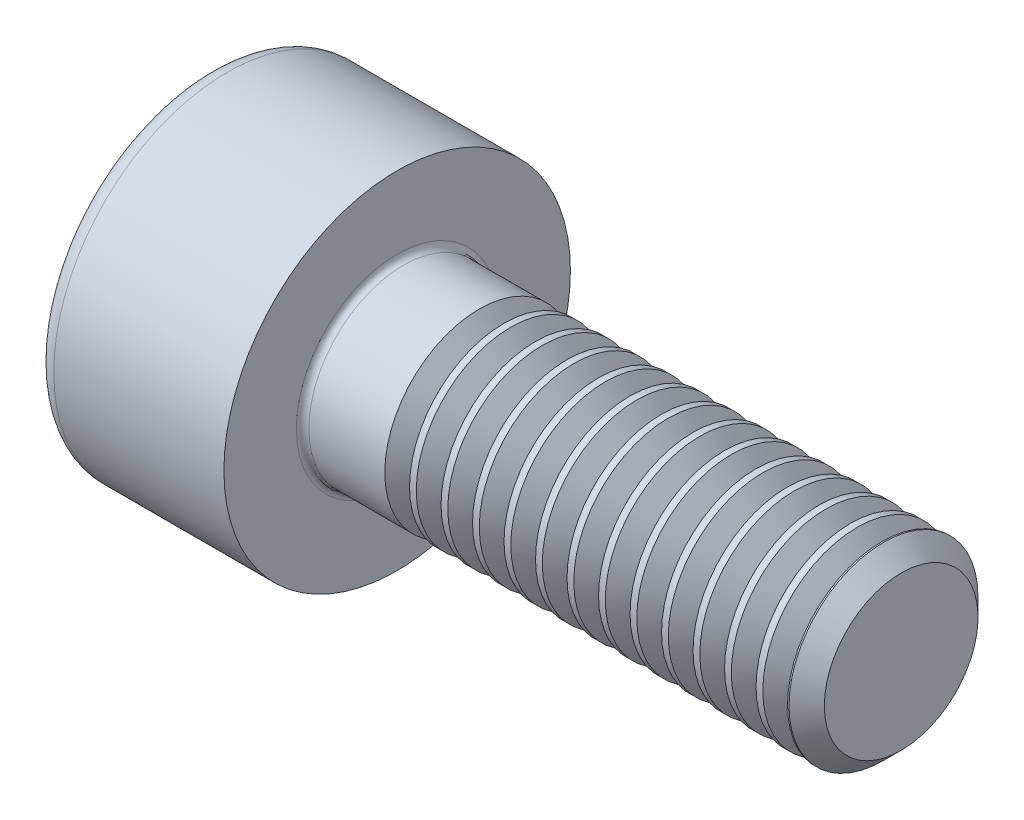
ISO-10303-21;
HEADER;
FILE_DESCRIPTION(('STEP AP214'),'2;1');
FILE_NAME('part.step','',(''),(''),'','','');
FILE_SCHEMA(('AUTOMOTIVE_DESIGN { 1 0 10303 214 1 1 1 1 }'));
ENDSEC;
DATA;
#1=APPLICATION_CONTEXT('core data for automotive mechanical design processes');
#2=APPLICATION_PROTOCOL_DEFINITION('international standard','automotive_design',2000,#1);
#3=PRODUCT_CONTEXT('',#1,'mechanical');
#4=PRODUCT('Part','Part','',(#3));
#5=PRODUCT_RELATED_PRODUCT_CATEGORY('part','',(#4));
#6=PRODUCT_DEFINITION_FORMATION('','',#4);
#7=PRODUCT_DEFINITION_CONTEXT('part definition',#1,'design');
#8=PRODUCT_DEFINITION('design','',#6,#7);
#9=PRODUCT_DEFINITION_SHAPE('','',#8);
#10=(LENGTH_UNIT() NAMED_UNIT(*) SI_UNIT(.MILLI.,.METRE.));
#11=(NAMED_UNIT(*) PLANE_ANGLE_UNIT() SI_UNIT($,.RADIAN.));
#12=(NAMED_UNIT(*) SI_UNIT($,.STERADIAN.) SOLID_ANGLE_UNIT());
#13=UNCERTAINTY_MEASURE_WITH_UNIT(LENGTH_MEASURE(1.E-05),#10,'distance_accuracy_value','');
#14=(GEOMETRIC_REPRESENTATION_CONTEXT(3) GLOBAL_UNCERTAINTY_ASSIGNED_CONTEXT((#13)) GLOBAL_UNIT_ASSIGNED_CONTEXT((#10,
#11,#12)) REPRESENTATION_CONTEXT('',''));
#15=CARTESIAN_POINT('',(0.,0.,0.));
#16=DIRECTION('',(0.,0.,1.));
#17=DIRECTION('',(1.,0.,0.));
#18=AXIS2_PLACEMENT_3D('',#15,#16,#17);
#19=CARTESIAN_POINT('',(0.,0.,0.));
#20=DIRECTION('',(-1.,0.,0.));
#21=DIRECTION('',(0.,0.,1.));
#22=AXIS2_PLACEMENT_3D('',#19,#20,#21);
#23=PLANE('',#22);
#24=DIRECTION('',(0.,-0.499999999999998,0.86602540378444));
#25=VECTOR('',#24,1.);
#26=CARTESIAN_POINT('',(0.,1.45492267835785,0.));
#27=LINE('',#26,#25);
#28=CARTESIAN_POINT('',(0.,1.45492267835785,0.));
#29=VERTEX_POINT('',#28);
#30=CARTESIAN_POINT('',(0.,0.727461339178927,1.26));
#31=VERTEX_POINT('',#30);
#32=EDGE_CURVE('E462',#29,#31,#27,.T.);
#33=ORIENTED_EDGE('',*,*,#32,.T.);
#34=DIRECTION('',(0.,1.,0.));
#35=VECTOR('',#34,1.);
#36=CARTESIAN_POINT('',(0.,-0.727461339178929,1.26));
#37=LINE('',#36,#35);
#38=CARTESIAN_POINT('',(0.,-0.727461339178929,1.26));
#39=VERTEX_POINT('',#38);
#40=EDGE_CURVE('E131',#39,#31,#37,.T.);
#41=ORIENTED_EDGE('',*,*,#40,.F.);
#42=DIRECTION('',(0.,-0.500000000000001,-0.866025403784438));
#43=VECTOR('',#42,1.);
#44=CARTESIAN_POINT('',(0.,-0.727461339178929,1.26));
#45=LINE('',#44,#43);
#46=CARTESIAN_POINT('',(0.,-1.45492267835786,0.));
#47=VERTEX_POINT('',#46);
#48=EDGE_CURVE('E481',#39,#47,#45,.T.);
#49=ORIENTED_EDGE('',*,*,#48,.T.);
#50=DIRECTION('',(0.,0.499999999999998,-0.86602540378444));
#51=VECTOR('',#50,1.);
#52=CARTESIAN_POINT('',(0.,-1.45492267835786,0.));
#53=LINE('',#52,#51);
#54=CARTESIAN_POINT('',(0.,-0.727461339178934,-1.26));
#55=VERTEX_POINT('',#54);
#56=EDGE_CURVE('E484',#47,#55,#53,.T.);
#57=ORIENTED_EDGE('',*,*,#56,.T.);
#58=DIRECTION('',(0.,-1.,0.));
#59=VECTOR('',#58,1.);
#60=CARTESIAN_POINT('',(0.,0.727461339178923,-1.26));
#61=LINE('',#60,#59);
#62=CARTESIAN_POINT('',(0.,0.727461339178923,-1.26));
#63=VERTEX_POINT('',#62);
#64=EDGE_CURVE('E487',#63,#55,#61,.T.);
#65=ORIENTED_EDGE('',*,*,#64,.F.);
#66=DIRECTION('',(0.,-0.500000000000001,-0.866025403784438));
#67=VECTOR('',#66,1.);
#68=CARTESIAN_POINT('',(0.,1.45492267835785,0.));
#69=LINE('',#68,#67);
#70=EDGE_CURVE('E126',#29,#63,#69,.T.);
#71=ORIENTED_EDGE('',*,*,#70,.F.);
#72=EDGE_LOOP('',(#33,#41,#49,#57,#65,#71));
#73=FACE_BOUND('',#72,.T.);
#74=CARTESIAN_POINT('',(0.,0.,0.));
#75=DIRECTION('',(-1.,0.,0.));
#76=DIRECTION('',(0.,0.,1.));
#77=AXIS2_PLACEMENT_3D('',#74,#75,#76);
#78=CIRCLE('',#77,2.45);
#79=CARTESIAN_POINT('',(0.,0.,2.45));
#80=VERTEX_POINT('',#79);
#81=EDGE_CURVE('E43',#80,#80,#78,.T.);
#82=ORIENTED_EDGE('',*,*,#81,.T.);
#83=EDGE_LOOP('',(#82));
#84=FACE_BOUND('',#83,.T.);
#85=ADVANCED_FACE('F35',(#73,#84),#23,.T.);
#86=CARTESIAN_POINT('',(-31.75,0.,0.));
#87=DIRECTION('',(-1.,0.,0.));
#88=DIRECTION('',(0.,0.,1.));
#89=AXIS2_PLACEMENT_3D('',#86,#87,#88);
#90=CYLINDRICAL_SURFACE('',#89,2.75);
#91=CARTESIAN_POINT('',(0.300000000000002,0.,0.));
#92=DIRECTION('',(-1.,0.,0.));
#93=DIRECTION('',(0.,0.,1.));
#94=AXIS2_PLACEMENT_3D('',#91,#92,#93);
#95=CIRCLE('',#94,2.75);
#96=CARTESIAN_POINT('',(0.300000000000002,0.,2.75));
#97=VERTEX_POINT('',#96);
#98=EDGE_CURVE('E11',#97,#97,#95,.F.);
#99=ORIENTED_EDGE('',*,*,#98,.T.);
#100=EDGE_LOOP('',(#99));
#101=FACE_BOUND('',#100,.T.);
#102=CARTESIAN_POINT('',(3.,0.,0.));
#103=DIRECTION('',(-1.,0.,0.));
#104=DIRECTION('',(0.,0.,1.));
#105=AXIS2_PLACEMENT_3D('',#102,#103,#104);
#106=CIRCLE('',#105,2.75);
#107=CARTESIAN_POINT('',(3.,0.,2.75));
#108=VERTEX_POINT('',#107);
#109=EDGE_CURVE('E149',#108,#108,#106,.T.);
#110=ORIENTED_EDGE('',*,*,#109,.T.);
#111=EDGE_LOOP('',(#110));
#112=FACE_BOUND('',#111,.T.);
#113=ADVANCED_FACE('F173',(#101,#112),#90,.T.);
#114=CARTESIAN_POINT('',(3.,2.75,0.));
#115=DIRECTION('',(1.,0.,0.));
#116=DIRECTION('',(0.,0.,-1.));
#117=AXIS2_PLACEMENT_3D('',#114,#115,#116);
#118=PLANE('',#117);
#119=CARTESIAN_POINT('',(3.,0.,0.));
#120=DIRECTION('',(1.,0.,0.));
#121=DIRECTION('',(0.,0.,-1.));
#122=AXIS2_PLACEMENT_3D('',#119,#120,#121);
#123=CIRCLE('',#122,1.59999999999999);
#124=CARTESIAN_POINT('',(3.,0.,-1.59999999999999));
#125=VERTEX_POINT('',#124);
#126=EDGE_CURVE('E152',#125,#125,#123,.F.);
#127=ORIENTED_EDGE('',*,*,#126,.T.);
#128=EDGE_LOOP('',(#127));
#129=FACE_BOUND('',#128,.T.);
#130=ORIENTED_EDGE('',*,*,#109,.F.);
#131=EDGE_LOOP('',(#130));
#132=FACE_BOUND('',#131,.T.);
#133=ADVANCED_FACE('F179',(#129,#132),#118,.T.);
#134=CARTESIAN_POINT('',(-31.75,0.,0.));
#135=DIRECTION('',(-1.,0.,0.));
#136=DIRECTION('',(0.,0.,1.));
#137=AXIS2_PLACEMENT_3D('',#134,#135,#136);
#138=CYLINDRICAL_SURFACE('',#137,1.49999999999999);
#139=CARTESIAN_POINT('',(4.30359178553217,0.,0.));
#140=DIRECTION('',(-1.,0.,0.));
#141=DIRECTION('',(0.,-1.,0.));
#142=AXIS2_PLACEMENT_3D('',#139,#140,#141);
#143=CIRCLE('',#142,1.5);
#144=CARTESIAN_POINT('',(4.30359178553217,-1.5,0.));
#145=VERTEX_POINT('',#144);
#146=EDGE_CURVE('E457',#145,#145,#143,.T.);
#147=ORIENTED_EDGE('',*,*,#146,.T.);
#148=EDGE_LOOP('',(#147));
#149=FACE_BOUND('',#148,.T.);
#150=CARTESIAN_POINT('',(3.1,0.,0.));
#151=DIRECTION('',(1.,0.,0.));
#152=DIRECTION('',(0.,0.,-1.));
#153=AXIS2_PLACEMENT_3D('',#150,#151,#152);
#154=CIRCLE('',#153,1.49999999999999);
#155=CARTESIAN_POINT('',(3.1,0.,-1.49999999999999));
#156=VERTEX_POINT('',#155);
#157=EDGE_CURVE('E155',#156,#156,#154,.T.);
#158=ORIENTED_EDGE('',*,*,#157,.T.);
#159=EDGE_LOOP('',(#158));
#160=FACE_BOUND('',#159,.T.);
#161=ADVANCED_FACE('F169',(#149,#160),#138,.T.);
#162=CARTESIAN_POINT('',(3.1,0.,0.));
#163=DIRECTION('',(1.,0.,0.));
#164=DIRECTION('',(0.,0.,-1.));
#165=AXIS2_PLACEMENT_3D('',#162,#163,#164);
#166=TOROIDAL_SURFACE('',#165,1.59999999999999,0.1);
#167=ORIENTED_EDGE('',*,*,#157,.F.);
#168=EDGE_LOOP('',(#167));
#169=FACE_BOUND('',#168,.T.);
#170=ORIENTED_EDGE('',*,*,#126,.F.);
#171=EDGE_LOOP('',(#170));
#172=FACE_BOUND('',#171,.T.);
#173=ADVANCED_FACE('F162',(#169,#172),#166,.F.);
#174=CARTESIAN_POINT('',(0.300000000000002,0.,0.));
#175=DIRECTION('',(-1.,0.,0.));
#176=DIRECTION('',(0.,0.,1.));
#177=AXIS2_PLACEMENT_3D('',#174,#175,#176);
#178=TOROIDAL_SURFACE('',#177,2.45,0.3);
#179=ORIENTED_EDGE('',*,*,#98,.F.);
#180=EDGE_LOOP('',(#179));
#181=FACE_BOUND('',#180,.T.);
#182=ORIENTED_EDGE('',*,*,#81,.F.);
#183=EDGE_LOOP('',(#182));
#184=FACE_BOUND('',#183,.T.);
#185=ADVANCED_FACE('F37',(#181,#184),#178,.T.);
#186=CARTESIAN_POINT('',(1.3,1.45492267835785,0.));
#187=DIRECTION('',(0.,-0.86602540378444,-0.499999999999998));
#188=DIRECTION('',(0.,0.499999999999998,-0.86602540378444));
#189=AXIS2_PLACEMENT_3D('',#186,#187,#188);
#190=PLANE('',#189);
#191=ORIENTED_EDGE('',*,*,#32,.F.);
#192=DIRECTION('',(-1.,0.,0.));
#193=VECTOR('',#192,1.);
#194=CARTESIAN_POINT('',(1.3,1.45492267835785,0.));
#195=LINE('',#194,#193);
#196=CARTESIAN_POINT('',(1.3,1.45492267835785,0.));
#197=VERTEX_POINT('',#196);
#198=EDGE_CURVE('E478',#197,#29,#195,.T.);
#199=ORIENTED_EDGE('',*,*,#198,.F.);
#200=DIRECTION('',(0.,-0.499999999999998,0.86602540378444));
#201=VECTOR('',#200,1.);
#202=CARTESIAN_POINT('',(1.3,1.45492267835785,0.));
#203=LINE('',#202,#201);
#204=CARTESIAN_POINT('',(1.3,1.09119200876839,0.629999999999996));
#205=VERTEX_POINT('',#204);
#206=EDGE_CURVE('E118',#197,#205,#203,.T.);
#207=ORIENTED_EDGE('',*,*,#206,.T.);
#208=CARTESIAN_POINT('',(1.3,0.727461339178927,1.26));
#209=VERTEX_POINT('',#208);
#210=EDGE_CURVE('E109',#205,#209,#203,.T.);
#211=ORIENTED_EDGE('',*,*,#210,.T.);
#212=DIRECTION('',(-1.,0.,0.));
#213=VECTOR('',#212,1.);
#214=CARTESIAN_POINT('',(1.3,0.727461339178927,1.26));
#215=LINE('',#214,#213);
#216=EDGE_CURVE('E123',#209,#31,#215,.T.);
#217=ORIENTED_EDGE('',*,*,#216,.T.);
#218=EDGE_LOOP('',(#191,#199,#207,#211,#217));
#219=FACE_BOUND('',#218,.T.);
#220=ADVANCED_FACE('F122',(#219),#190,.T.);
#221=CARTESIAN_POINT('',(1.3,-0.727461339178929,1.26));
#222=DIRECTION('',(0.,0.,1.));
#223=DIRECTION('',(0.,-1.,0.));
#224=AXIS2_PLACEMENT_3D('',#221,#222,#223);
#225=PLANE('',#224);
#226=ORIENTED_EDGE('',*,*,#40,.T.);
#227=ORIENTED_EDGE('',*,*,#216,.F.);
#228=DIRECTION('',(0.,1.,0.));
#229=VECTOR('',#228,1.);
#230=CARTESIAN_POINT('',(1.3,-0.727461339178929,1.26));
#231=LINE('',#230,#229);
#232=CARTESIAN_POINT('',(1.3,0.,1.26));
#233=VERTEX_POINT('',#232);
#234=EDGE_CURVE('E106',#233,#209,#231,.T.);
#235=ORIENTED_EDGE('',*,*,#234,.F.);
#236=CARTESIAN_POINT('',(1.3,-0.727461339178929,1.26));
#237=VERTEX_POINT('',#236);
#238=EDGE_CURVE('E117',#237,#233,#231,.T.);
#239=ORIENTED_EDGE('',*,*,#238,.F.);
#240=DIRECTION('',(-1.,0.,0.));
#241=VECTOR('',#240,1.);
#242=CARTESIAN_POINT('',(1.3,-0.727461339178929,1.26));
#243=LINE('',#242,#241);
#244=EDGE_CURVE('E133',#237,#39,#243,.T.);
#245=ORIENTED_EDGE('',*,*,#244,.T.);
#246=EDGE_LOOP('',(#226,#227,#235,#239,#245));
#247=FACE_BOUND('',#246,.T.);
#248=ADVANCED_FACE('F128',(#247),#225,.F.);
#249=CARTESIAN_POINT('',(1.3,-0.727461339178929,1.26));
#250=DIRECTION('',(0.,0.866025403784438,-0.500000000000001));
#251=DIRECTION('',(0.,0.500000000000001,0.866025403784438));
#252=AXIS2_PLACEMENT_3D('',#249,#250,#251);
#253=PLANE('',#252);
#254=ORIENTED_EDGE('',*,*,#48,.F.);
#255=ORIENTED_EDGE('',*,*,#244,.F.);
#256=DIRECTION('',(0.,-0.500000000000001,-0.866025403784438));
#257=VECTOR('',#256,1.);
#258=CARTESIAN_POINT('',(1.3,-0.727461339178929,1.26));
#259=LINE('',#258,#257);
#260=CARTESIAN_POINT('',(1.3,-1.09119200876839,0.630000000000002));
#261=VERTEX_POINT('',#260);
#262=EDGE_CURVE('E465',#237,#261,#259,.T.);
#263=ORIENTED_EDGE('',*,*,#262,.T.);
#264=CARTESIAN_POINT('',(1.3,-1.45492267835786,0.));
#265=VERTEX_POINT('',#264);
#266=EDGE_CURVE('E464',#261,#265,#259,.T.);
#267=ORIENTED_EDGE('',*,*,#266,.T.);
#268=DIRECTION('',(-1.,0.,0.));
#269=VECTOR('',#268,1.);
#270=CARTESIAN_POINT('',(1.3,-1.45492267835786,0.));
#271=LINE('',#270,#269);
#272=EDGE_CURVE('E138',#265,#47,#271,.T.);
#273=ORIENTED_EDGE('',*,*,#272,.T.);
#274=EDGE_LOOP('',(#254,#255,#263,#267,#273));
#275=FACE_BOUND('',#274,.T.);
#276=ADVANCED_FACE('F207',(#275),#253,.T.);
#277=CARTESIAN_POINT('',(1.3,-1.45492267835786,0.));
#278=DIRECTION('',(0.,0.86602540378444,0.499999999999998));
#279=DIRECTION('',(0.,-0.499999999999998,0.86602540378444));
#280=AXIS2_PLACEMENT_3D('',#277,#278,#279);
#281=PLANE('',#280);
#282=ORIENTED_EDGE('',*,*,#56,.F.);
#283=ORIENTED_EDGE('',*,*,#272,.F.);
#284=DIRECTION('',(0.,0.499999999999998,-0.86602540378444));
#285=VECTOR('',#284,1.);
#286=CARTESIAN_POINT('',(1.3,-1.45492267835786,0.));
#287=LINE('',#286,#285);
#288=CARTESIAN_POINT('',(1.3,-1.0911920087684,-0.629999999999999));
#289=VERTEX_POINT('',#288);
#290=EDGE_CURVE('E469',#265,#289,#287,.T.);
#291=ORIENTED_EDGE('',*,*,#290,.T.);
#292=CARTESIAN_POINT('',(1.3,-0.727461339178934,-1.26));
#293=VERTEX_POINT('',#292);
#294=EDGE_CURVE('E468',#289,#293,#287,.T.);
#295=ORIENTED_EDGE('',*,*,#294,.T.);
#296=DIRECTION('',(-1.,0.,0.));
#297=VECTOR('',#296,1.);
#298=CARTESIAN_POINT('',(1.3,-0.727461339178934,-1.26));
#299=LINE('',#298,#297);
#300=EDGE_CURVE('E496',#293,#55,#299,.T.);
#301=ORIENTED_EDGE('',*,*,#300,.T.);
#302=EDGE_LOOP('',(#282,#283,#291,#295,#301));
#303=FACE_BOUND('',#302,.T.);
#304=ADVANCED_FACE('F210',(#303),#281,.T.);
#305=CARTESIAN_POINT('',(1.3,0.727461339178923,-1.26));
#306=DIRECTION('',(0.,0.,-1.));
#307=DIRECTION('',(0.,1.,0.));
#308=AXIS2_PLACEMENT_3D('',#305,#306,#307);
#309=PLANE('',#308);
#310=ORIENTED_EDGE('',*,*,#64,.T.);
#311=ORIENTED_EDGE('',*,*,#300,.F.);
#312=DIRECTION('',(0.,-1.,0.));
#313=VECTOR('',#312,1.);
#314=CARTESIAN_POINT('',(1.3,0.727461339178923,-1.26));
#315=LINE('',#314,#313);
#316=CARTESIAN_POINT('',(1.3,0.,-1.26));
#317=VERTEX_POINT('',#316);
#318=EDGE_CURVE('E472',#317,#293,#315,.T.);
#319=ORIENTED_EDGE('',*,*,#318,.F.);
#320=CARTESIAN_POINT('',(1.3,0.727461339178923,-1.26));
#321=VERTEX_POINT('',#320);
#322=EDGE_CURVE('E50',#321,#317,#315,.T.);
#323=ORIENTED_EDGE('',*,*,#322,.F.);
#324=DIRECTION('',(-1.,0.,0.));
#325=VECTOR('',#324,1.);
#326=CARTESIAN_POINT('',(1.3,0.727461339178923,-1.26));
#327=LINE('',#326,#325);
#328=EDGE_CURVE('E493',#321,#63,#327,.T.);
#329=ORIENTED_EDGE('',*,*,#328,.T.);
#330=EDGE_LOOP('',(#310,#311,#319,#323,#329));
#331=FACE_BOUND('',#330,.T.);
#332=ADVANCED_FACE('F214',(#331),#309,.F.);
#333=CARTESIAN_POINT('',(1.3,1.45492267835785,0.));
#334=DIRECTION('',(0.,0.866025403784438,-0.500000000000001));
#335=DIRECTION('',(0.,0.500000000000001,0.866025403784438));
#336=AXIS2_PLACEMENT_3D('',#333,#334,#335);
#337=PLANE('',#336);
#338=ORIENTED_EDGE('',*,*,#70,.T.);
#339=ORIENTED_EDGE('',*,*,#328,.F.);
#340=DIRECTION('',(0.,-0.500000000000001,-0.866025403784438));
#341=VECTOR('',#340,1.);
#342=CARTESIAN_POINT('',(1.3,1.45492267835785,0.));
#343=LINE('',#342,#341);
#344=CARTESIAN_POINT('',(1.3,1.09119200876839,-0.63));
#345=VERTEX_POINT('',#344);
#346=EDGE_CURVE('E474',#345,#321,#343,.T.);
#347=ORIENTED_EDGE('',*,*,#346,.F.);
#348=EDGE_CURVE('E475',#197,#345,#343,.T.);
#349=ORIENTED_EDGE('',*,*,#348,.F.);
#350=ORIENTED_EDGE('',*,*,#198,.T.);
#351=EDGE_LOOP('',(#338,#339,#347,#349,#350));
#352=FACE_BOUND('',#351,.T.);
#353=ADVANCED_FACE('F218',(#352),#337,.F.);
#354=CARTESIAN_POINT('',(1.3,2.18238401753678,-1.26));
#355=DIRECTION('',(1.,0.,0.));
#356=DIRECTION('',(0.,0.,-1.));
#357=AXIS2_PLACEMENT_3D('',#354,#355,#356);
#358=PLANE('',#357);
#359=ORIENTED_EDGE('',*,*,#318,.T.);
#360=ORIENTED_EDGE('',*,*,#294,.F.);
#361=CARTESIAN_POINT('',(1.3,0.,0.));
#362=DIRECTION('',(-1.,0.,0.));
#363=DIRECTION('',(0.,0.,1.));
#364=AXIS2_PLACEMENT_3D('',#361,#362,#363);
#365=CIRCLE('',#364,1.26);
#366=EDGE_CURVE('E513',#317,#289,#365,.T.);
#367=ORIENTED_EDGE('',*,*,#366,.F.);
#368=EDGE_LOOP('',(#359,#360,#367));
#369=FACE_BOUND('',#368,.T.);
#370=ADVANCED_FACE('F222',(#369),#358,.F.);
#371=ORIENTED_EDGE('',*,*,#290,.F.);
#372=ORIENTED_EDGE('',*,*,#266,.F.);
#373=EDGE_CURVE('E136',#289,#261,#365,.T.);
#374=ORIENTED_EDGE('',*,*,#373,.F.);
#375=EDGE_LOOP('',(#371,#372,#374));
#376=FACE_BOUND('',#375,.T.);
#377=ADVANCED_FACE('F226',(#376),#358,.F.);
#378=ORIENTED_EDGE('',*,*,#262,.F.);
#379=ORIENTED_EDGE('',*,*,#238,.T.);
#380=EDGE_CURVE('E132',#261,#233,#365,.T.);
#381=ORIENTED_EDGE('',*,*,#380,.F.);
#382=EDGE_LOOP('',(#378,#379,#381));
#383=FACE_BOUND('',#382,.T.);
#384=ADVANCED_FACE('F522',(#383),#358,.F.);
#385=ORIENTED_EDGE('',*,*,#234,.T.);
#386=ORIENTED_EDGE('',*,*,#210,.F.);
#387=EDGE_CURVE('E112',#233,#205,#365,.T.);
#388=ORIENTED_EDGE('',*,*,#387,.F.);
#389=EDGE_LOOP('',(#385,#386,#388));
#390=FACE_BOUND('',#389,.T.);
#391=ADVANCED_FACE('F108',(#390),#358,.F.);
#392=ORIENTED_EDGE('',*,*,#206,.F.);
#393=ORIENTED_EDGE('',*,*,#348,.T.);
#394=EDGE_CURVE('E143',#205,#345,#365,.T.);
#395=ORIENTED_EDGE('',*,*,#394,.F.);
#396=EDGE_LOOP('',(#392,#393,#395));
#397=FACE_BOUND('',#396,.T.);
#398=ADVANCED_FACE('F508',(#397),#358,.F.);
#399=ORIENTED_EDGE('',*,*,#346,.T.);
#400=ORIENTED_EDGE('',*,*,#322,.T.);
#401=EDGE_CURVE('E512',#345,#317,#365,.T.);
#402=ORIENTED_EDGE('',*,*,#401,.F.);
#403=EDGE_LOOP('',(#399,#400,#402));
#404=FACE_BOUND('',#403,.T.);
#405=ADVANCED_FACE('F203',(#404),#358,.F.);
#406=CARTESIAN_POINT('',(1.3,0.,0.));
#407=DIRECTION('',(-1.,0.,0.));
#408=DIRECTION('',(0.,0.,1.));
#409=AXIS2_PLACEMENT_3D('',#406,#407,#408);
#410=CONICAL_SURFACE('',#409,1.26,1.04719755119659);
#411=CARTESIAN_POINT('',(2.02746133917894,0.,0.));
#412=VERTEX_POINT('',#411);
#413=VERTEX_LOOP('',#412);
#414=FACE_BOUND('',#413,.T.);
#415=ORIENTED_EDGE('',*,*,#387,.T.);
#416=ORIENTED_EDGE('',*,*,#394,.T.);
#417=ORIENTED_EDGE('',*,*,#401,.T.);
#418=ORIENTED_EDGE('',*,*,#366,.T.);
#419=ORIENTED_EDGE('',*,*,#373,.T.);
#420=ORIENTED_EDGE('',*,*,#380,.T.);
#421=EDGE_LOOP('',(#415,#416,#417,#418,#419,#420));
#422=FACE_BOUND('',#421,.T.);
#423=ADVANCED_FACE('F200',(#414,#422),#410,.F.);
#424=CARTESIAN_POINT('',(4.69640821446782,0.,0.));
#425=DIRECTION('',(1.,0.,0.));
#426=DIRECTION('',(0.,1.,0.));
#427=AXIS2_PLACEMENT_3D('',#424,#425,#426);
#428=CONICAL_SURFACE('',#427,1.5,0.959931088596882);
#429=CARTESIAN_POINT('',(4.5,0.,0.));
#430=DIRECTION('',(-1.,0.,0.));
#431=DIRECTION('',(0.,-1.,0.));
#432=AXIS2_PLACEMENT_3D('',#429,#430,#431);
#433=CIRCLE('',#432,1.2195);
#434=CARTESIAN_POINT('',(4.5,-1.2195,0.));
#435=VERTEX_POINT('',#434);
#436=EDGE_CURVE('E454',#435,#435,#433,.T.);
#437=ORIENTED_EDGE('',*,*,#436,.F.);
#438=EDGE_LOOP('',(#437));
#439=FACE_BOUND('',#438,.T.);
#440=CARTESIAN_POINT('',(4.69640821446782,0.,0.));
#441=DIRECTION('',(-1.,0.,0.));
#442=DIRECTION('',(0.,-1.,0.));
#443=AXIS2_PLACEMENT_3D('',#440,#441,#442);
#444=CIRCLE('',#443,1.5);
#445=CARTESIAN_POINT('',(4.69640821446782,-1.5,0.));
#446=VERTEX_POINT('',#445);
#447=EDGE_CURVE('E460',#446,#446,#444,.T.);
#448=ORIENTED_EDGE('',*,*,#447,.T.);
#449=EDGE_LOOP('',(#448));
#450=FACE_BOUND('',#449,.T.);
#451=ADVANCED_FACE('F202',(#439,#450),#428,.T.);
#452=CARTESIAN_POINT('',(4.5,0.,0.));
#453=DIRECTION('',(-1.,0.,0.));
#454=DIRECTION('',(0.,-1.,0.));
#455=AXIS2_PLACEMENT_3D('',#452,#453,#454);
#456=CONICAL_SURFACE('',#455,1.2195,0.959931088596876);
#457=ORIENTED_EDGE('',*,*,#146,.F.);
#458=EDGE_LOOP('',(#457));
#459=FACE_BOUND('',#458,.T.);
#460=ORIENTED_EDGE('',*,*,#436,.T.);
#461=EDGE_LOOP('',(#460));
#462=FACE_BOUND('',#461,.T.);
#463=ADVANCED_FACE('F230',(#459,#462),#456,.T.);
#464=CARTESIAN_POINT('',(4.80359178553217,0.,0.));
#465=DIRECTION('',(-1.,0.,0.));
#466=DIRECTION('',(0.,-1.,0.));
#467=AXIS2_PLACEMENT_3D('',#464,#465,#466);
#468=CIRCLE('',#467,1.5);
#469=CARTESIAN_POINT('',(4.80359178553217,-1.5,0.));
#470=VERTEX_POINT('',#469);
#471=EDGE_CURVE('E448',#470,#470,#468,.T.);
#472=ORIENTED_EDGE('',*,*,#471,.T.);
#473=EDGE_LOOP('',(#472));
#474=FACE_BOUND('',#473,.T.);
#475=ORIENTED_EDGE('',*,*,#447,.F.);
#476=EDGE_LOOP('',(#475));
#477=FACE_BOUND('',#476,.T.);
#478=ADVANCED_FACE('F190',(#474,#477),#138,.T.);
#479=CARTESIAN_POINT('',(5.19640821446782,0.,0.));
#480=DIRECTION('',(1.,0.,0.));
#481=DIRECTION('',(0.,1.,0.));
#482=AXIS2_PLACEMENT_3D('',#479,#480,#481);
#483=CONICAL_SURFACE('',#482,1.5,0.959931088596882);
#484=CARTESIAN_POINT('',(5.,0.,0.));
#485=DIRECTION('',(-1.,0.,0.));
#486=DIRECTION('',(0.,-1.,0.));
#487=AXIS2_PLACEMENT_3D('',#484,#485,#486);
#488=CIRCLE('',#487,1.2195);
#489=CARTESIAN_POINT('',(5.,-1.2195,0.));
#490=VERTEX_POINT('',#489);
#491=EDGE_CURVE('E445',#490,#490,#488,.T.);
#492=ORIENTED_EDGE('',*,*,#491,.F.);
#493=EDGE_LOOP('',(#492));
#494=FACE_BOUND('',#493,.T.);
#495=CARTESIAN_POINT('',(5.19640821446782,0.,0.));
#496=DIRECTION('',(-1.,0.,0.));
#497=DIRECTION('',(0.,-1.,0.));
#498=AXIS2_PLACEMENT_3D('',#495,#496,#497);
#499=CIRCLE('',#498,1.5);
#500=CARTESIAN_POINT('',(5.19640821446782,-1.5,0.));
#501=VERTEX_POINT('',#500);
#502=EDGE_CURVE('E451',#501,#501,#499,.T.);
#503=ORIENTED_EDGE('',*,*,#502,.T.);
#504=EDGE_LOOP('',(#503));
#505=FACE_BOUND('',#504,.T.);
#506=ADVANCED_FACE('F235',(#494,#505),#483,.T.);
#507=CARTESIAN_POINT('',(5.,0.,0.));
#508=DIRECTION('',(-1.,0.,0.));
#509=DIRECTION('',(0.,-1.,0.));
#510=AXIS2_PLACEMENT_3D('',#507,#508,#509);
#511=CONICAL_SURFACE('',#510,1.2195,0.959931088596876);
#512=ORIENTED_EDGE('',*,*,#471,.F.);
#513=EDGE_LOOP('',(#512));
#514=FACE_BOUND('',#513,.T.);
#515=ORIENTED_EDGE('',*,*,#491,.T.);
#516=EDGE_LOOP('',(#515));
#517=FACE_BOUND('',#516,.T.);
#518=ADVANCED_FACE('F238',(#514,#517),#511,.T.);
#519=CARTESIAN_POINT('',(5.30359178553217,0.,0.));
#520=DIRECTION('',(-1.,0.,0.));
#521=DIRECTION('',(0.,-1.,0.));
#522=AXIS2_PLACEMENT_3D('',#519,#520,#521);
#523=CIRCLE('',#522,1.5);
#524=CARTESIAN_POINT('',(5.30359178553217,-1.5,0.));
#525=VERTEX_POINT('',#524);
#526=EDGE_CURVE('E439',#525,#525,#523,.T.);
#527=ORIENTED_EDGE('',*,*,#526,.T.);
#528=EDGE_LOOP('',(#527));
#529=FACE_BOUND('',#528,.T.);
#530=ORIENTED_EDGE('',*,*,#502,.F.);
#531=EDGE_LOOP('',(#530));
#532=FACE_BOUND('',#531,.T.);
#533=ADVANCED_FACE('F242',(#529,#532),#138,.T.);
#534=CARTESIAN_POINT('',(5.69640821446782,0.,0.));
#535=DIRECTION('',(1.,0.,0.));
#536=DIRECTION('',(0.,1.,0.));
#537=AXIS2_PLACEMENT_3D('',#534,#535,#536);
#538=CONICAL_SURFACE('',#537,1.5,0.959931088596882);
#539=CARTESIAN_POINT('',(5.5,0.,0.));
#540=DIRECTION('',(-1.,0.,0.));
#541=DIRECTION('',(0.,-1.,0.));
#542=AXIS2_PLACEMENT_3D('',#539,#540,#541);
#543=CIRCLE('',#542,1.2195);
#544=CARTESIAN_POINT('',(5.5,-1.2195,0.));
#545=VERTEX_POINT('',#544);
#546=EDGE_CURVE('E436',#545,#545,#543,.T.);
#547=ORIENTED_EDGE('',*,*,#546,.F.);
#548=EDGE_LOOP('',(#547));
#549=FACE_BOUND('',#548,.T.);
#550=CARTESIAN_POINT('',(5.69640821446782,0.,0.));
#551=DIRECTION('',(-1.,0.,0.));
#552=DIRECTION('',(0.,-1.,0.));
#553=AXIS2_PLACEMENT_3D('',#550,#551,#552);
#554=CIRCLE('',#553,1.5);
#555=CARTESIAN_POINT('',(5.69640821446782,-1.5,0.));
#556=VERTEX_POINT('',#555);
#557=EDGE_CURVE('E442',#556,#556,#554,.T.);
#558=ORIENTED_EDGE('',*,*,#557,.T.);
#559=EDGE_LOOP('',(#558));
#560=FACE_BOUND('',#559,.T.);
#561=ADVANCED_FACE('F244',(#549,#560),#538,.T.);
#562=CARTESIAN_POINT('',(5.5,0.,0.));
#563=DIRECTION('',(-1.,0.,0.));
#564=DIRECTION('',(0.,-1.,0.));
#565=AXIS2_PLACEMENT_3D('',#562,#563,#564);
#566=CONICAL_SURFACE('',#565,1.2195,0.959931088596876);
#567=ORIENTED_EDGE('',*,*,#526,.F.);
#568=EDGE_LOOP('',(#567));
#569=FACE_BOUND('',#568,.T.);
#570=ORIENTED_EDGE('',*,*,#546,.T.);
#571=EDGE_LOOP('',(#570));
#572=FACE_BOUND('',#571,.T.);
#573=ADVANCED_FACE('F247',(#569,#572),#566,.T.);
#574=CARTESIAN_POINT('',(5.80359178553217,0.,0.));
#575=DIRECTION('',(-1.,0.,0.));
#576=DIRECTION('',(0.,-1.,0.));
#577=AXIS2_PLACEMENT_3D('',#574,#575,#576);
#578=CIRCLE('',#577,1.5);
#579=CARTESIAN_POINT('',(5.80359178553217,-1.5,0.));
#580=VERTEX_POINT('',#579);
#581=EDGE_CURVE('E430',#580,#580,#578,.T.);
#582=ORIENTED_EDGE('',*,*,#581,.T.);
#583=EDGE_LOOP('',(#582));
#584=FACE_BOUND('',#583,.T.);
#585=ORIENTED_EDGE('',*,*,#557,.F.);
#586=EDGE_LOOP('',(#585));
#587=FACE_BOUND('',#586,.T.);
#588=ADVANCED_FACE('F251',(#584,#587),#138,.T.);
#589=CARTESIAN_POINT('',(6.19640821446782,0.,0.));
#590=DIRECTION('',(1.,0.,0.));
#591=DIRECTION('',(0.,1.,0.));
#592=AXIS2_PLACEMENT_3D('',#589,#590,#591);
#593=CONICAL_SURFACE('',#592,1.5,0.959931088596882);
#594=CARTESIAN_POINT('',(6.,0.,0.));
#595=DIRECTION('',(-1.,0.,0.));
#596=DIRECTION('',(0.,-1.,0.));
#597=AXIS2_PLACEMENT_3D('',#594,#595,#596);
#598=CIRCLE('',#597,1.2195);
#599=CARTESIAN_POINT('',(6.,-1.2195,0.));
#600=VERTEX_POINT('',#599);
#601=EDGE_CURVE('E427',#600,#600,#598,.T.);
#602=ORIENTED_EDGE('',*,*,#601,.F.);
#603=EDGE_LOOP('',(#602));
#604=FACE_BOUND('',#603,.T.);
#605=CARTESIAN_POINT('',(6.19640821446782,0.,0.));
#606=DIRECTION('',(-1.,0.,0.));
#607=DIRECTION('',(0.,-1.,0.));
#608=AXIS2_PLACEMENT_3D('',#605,#606,#607);
#609=CIRCLE('',#608,1.5);
#610=CARTESIAN_POINT('',(6.19640821446782,-1.5,0.));
#611=VERTEX_POINT('',#610);
#612=EDGE_CURVE('E433',#611,#611,#609,.T.);
#613=ORIENTED_EDGE('',*,*,#612,.T.);
#614=EDGE_LOOP('',(#613));
#615=FACE_BOUND('',#614,.T.);
#616=ADVANCED_FACE('F253',(#604,#615),#593,.T.);
#617=CARTESIAN_POINT('',(6.,0.,0.));
#618=DIRECTION('',(-1.,0.,0.));
#619=DIRECTION('',(0.,-1.,0.));
#620=AXIS2_PLACEMENT_3D('',#617,#618,#619);
#621=CONICAL_SURFACE('',#620,1.2195,0.959931088596876);
#622=ORIENTED_EDGE('',*,*,#581,.F.);
#623=EDGE_LOOP('',(#622));
#624=FACE_BOUND('',#623,.T.);
#625=ORIENTED_EDGE('',*,*,#601,.T.);
#626=EDGE_LOOP('',(#625));
#627=FACE_BOUND('',#626,.T.);
#628=ADVANCED_FACE('F256',(#624,#627),#621,.T.);
#629=CARTESIAN_POINT('',(6.30359178553217,0.,0.));
#630=DIRECTION('',(-1.,0.,0.));
#631=DIRECTION('',(0.,-1.,0.));
#632=AXIS2_PLACEMENT_3D('',#629,#630,#631);
#633=CIRCLE('',#632,1.5);
#634=CARTESIAN_POINT('',(6.30359178553217,-1.5,0.));
#635=VERTEX_POINT('',#634);
#636=EDGE_CURVE('E421',#635,#635,#633,.T.);
#637=ORIENTED_EDGE('',*,*,#636,.T.);
#638=EDGE_LOOP('',(#637));
#639=FACE_BOUND('',#638,.T.);
#640=ORIENTED_EDGE('',*,*,#612,.F.);
#641=EDGE_LOOP('',(#640));
#642=FACE_BOUND('',#641,.T.);
#643=ADVANCED_FACE('F260',(#639,#642),#138,.T.);
#644=CARTESIAN_POINT('',(6.69640821446782,0.,0.));
#645=DIRECTION('',(1.,0.,0.));
#646=DIRECTION('',(0.,1.,0.));
#647=AXIS2_PLACEMENT_3D('',#644,#645,#646);
#648=CONICAL_SURFACE('',#647,1.5,0.959931088596882);
#649=CARTESIAN_POINT('',(6.5,0.,0.));
#650=DIRECTION('',(-1.,0.,0.));
#651=DIRECTION('',(0.,-1.,0.));
#652=AXIS2_PLACEMENT_3D('',#649,#650,#651);
#653=CIRCLE('',#652,1.2195);
#654=CARTESIAN_POINT('',(6.5,-1.2195,0.));
#655=VERTEX_POINT('',#654);
#656=EDGE_CURVE('E418',#655,#655,#653,.T.);
#657=ORIENTED_EDGE('',*,*,#656,.F.);
#658=EDGE_LOOP('',(#657));
#659=FACE_BOUND('',#658,.T.);
#660=CARTESIAN_POINT('',(6.69640821446782,0.,0.));
#661=DIRECTION('',(-1.,0.,0.));
#662=DIRECTION('',(0.,-1.,0.));
#663=AXIS2_PLACEMENT_3D('',#660,#661,#662);
#664=CIRCLE('',#663,1.5);
#665=CARTESIAN_POINT('',(6.69640821446782,-1.5,0.));
#666=VERTEX_POINT('',#665);
#667=EDGE_CURVE('E424',#666,#666,#664,.T.);
#668=ORIENTED_EDGE('',*,*,#667,.T.);
#669=EDGE_LOOP('',(#668));
#670=FACE_BOUND('',#669,.T.);
#671=ADVANCED_FACE('F262',(#659,#670),#648,.T.);
#672=CARTESIAN_POINT('',(6.5,0.,0.));
#673=DIRECTION('',(-1.,0.,0.));
#674=DIRECTION('',(0.,-1.,0.));
#675=AXIS2_PLACEMENT_3D('',#672,#673,#674);
#676=CONICAL_SURFACE('',#675,1.2195,0.959931088596876);
#677=ORIENTED_EDGE('',*,*,#636,.F.);
#678=EDGE_LOOP('',(#677));
#679=FACE_BOUND('',#678,.T.);
#680=ORIENTED_EDGE('',*,*,#656,.T.);
#681=EDGE_LOOP('',(#680));
#682=FACE_BOUND('',#681,.T.);
#683=ADVANCED_FACE('F265',(#679,#682),#676,.T.);
#684=CARTESIAN_POINT('',(6.80359178553217,0.,0.));
#685=DIRECTION('',(-1.,0.,0.));
#686=DIRECTION('',(0.,-1.,0.));
#687=AXIS2_PLACEMENT_3D('',#684,#685,#686);
#688=CIRCLE('',#687,1.5);
#689=CARTESIAN_POINT('',(6.80359178553217,-1.5,0.));
#690=VERTEX_POINT('',#689);
#691=EDGE_CURVE('E412',#690,#690,#688,.T.);
#692=ORIENTED_EDGE('',*,*,#691,.T.);
#693=EDGE_LOOP('',(#692));
#694=FACE_BOUND('',#693,.T.);
#695=ORIENTED_EDGE('',*,*,#667,.F.);
#696=EDGE_LOOP('',(#695));
#697=FACE_BOUND('',#696,.T.);
#698=ADVANCED_FACE('F269',(#694,#697),#138,.T.);
#699=CARTESIAN_POINT('',(7.19640821446782,0.,0.));
#700=DIRECTION('',(1.,0.,0.));
#701=DIRECTION('',(0.,1.,0.));
#702=AXIS2_PLACEMENT_3D('',#699,#700,#701);
#703=CONICAL_SURFACE('',#702,1.5,0.959931088596882);
#704=CARTESIAN_POINT('',(7.,0.,0.));
#705=DIRECTION('',(-1.,0.,0.));
#706=DIRECTION('',(0.,-1.,0.));
#707=AXIS2_PLACEMENT_3D('',#704,#705,#706);
#708=CIRCLE('',#707,1.2195);
#709=CARTESIAN_POINT('',(7.,-1.2195,0.));
#710=VERTEX_POINT('',#709);
#711=EDGE_CURVE('E409',#710,#710,#708,.T.);
#712=ORIENTED_EDGE('',*,*,#711,.F.);
#713=EDGE_LOOP('',(#712));
#714=FACE_BOUND('',#713,.T.);
#715=CARTESIAN_POINT('',(7.19640821446782,0.,0.));
#716=DIRECTION('',(-1.,0.,0.));
#717=DIRECTION('',(0.,-1.,0.));
#718=AXIS2_PLACEMENT_3D('',#715,#716,#717);
#719=CIRCLE('',#718,1.5);
#720=CARTESIAN_POINT('',(7.19640821446782,-1.5,0.));
#721=VERTEX_POINT('',#720);
#722=EDGE_CURVE('E415',#721,#721,#719,.T.);
#723=ORIENTED_EDGE('',*,*,#722,.T.);
#724=EDGE_LOOP('',(#723));
#725=FACE_BOUND('',#724,.T.);
#726=ADVANCED_FACE('F271',(#714,#725),#703,.T.);
#727=CARTESIAN_POINT('',(7.,0.,0.));
#728=DIRECTION('',(-1.,0.,0.));
#729=DIRECTION('',(0.,-1.,0.));
#730=AXIS2_PLACEMENT_3D('',#727,#728,#729);
#731=CONICAL_SURFACE('',#730,1.2195,0.959931088596876);
#732=ORIENTED_EDGE('',*,*,#691,.F.);
#733=EDGE_LOOP('',(#732));
#734=FACE_BOUND('',#733,.T.);
#735=ORIENTED_EDGE('',*,*,#711,.T.);
#736=EDGE_LOOP('',(#735));
#737=FACE_BOUND('',#736,.T.);
#738=ADVANCED_FACE('F274',(#734,#737),#731,.T.);
#739=CARTESIAN_POINT('',(7.30359178553217,0.,0.));
#740=DIRECTION('',(-1.,0.,0.));
#741=DIRECTION('',(0.,-1.,0.));
#742=AXIS2_PLACEMENT_3D('',#739,#740,#741);
#743=CIRCLE('',#742,1.5);
#744=CARTESIAN_POINT('',(7.30359178553217,-1.5,0.));
#745=VERTEX_POINT('',#744);
#746=EDGE_CURVE('E403',#745,#745,#743,.T.);
#747=ORIENTED_EDGE('',*,*,#746,.T.);
#748=EDGE_LOOP('',(#747));
#749=FACE_BOUND('',#748,.T.);
#750=ORIENTED_EDGE('',*,*,#722,.F.);
#751=EDGE_LOOP('',(#750));
#752=FACE_BOUND('',#751,.T.);
#753=ADVANCED_FACE('F278',(#749,#752),#138,.T.);
#754=CARTESIAN_POINT('',(7.69640821446782,0.,0.));
#755=DIRECTION('',(1.,0.,0.));
#756=DIRECTION('',(0.,1.,0.));
#757=AXIS2_PLACEMENT_3D('',#754,#755,#756);
#758=CONICAL_SURFACE('',#757,1.5,0.959931088596882);
#759=CARTESIAN_POINT('',(7.5,0.,0.));
#760=DIRECTION('',(-1.,0.,0.));
#761=DIRECTION('',(0.,-1.,0.));
#762=AXIS2_PLACEMENT_3D('',#759,#760,#761);
#763=CIRCLE('',#762,1.2195);
#764=CARTESIAN_POINT('',(7.5,-1.2195,0.));
#765=VERTEX_POINT('',#764);
#766=EDGE_CURVE('E400',#765,#765,#763,.T.);
#767=ORIENTED_EDGE('',*,*,#766,.F.);
#768=EDGE_LOOP('',(#767));
#769=FACE_BOUND('',#768,.T.);
#770=CARTESIAN_POINT('',(7.69640821446782,0.,0.));
#771=DIRECTION('',(-1.,0.,0.));
#772=DIRECTION('',(0.,-1.,0.));
#773=AXIS2_PLACEMENT_3D('',#770,#771,#772);
#774=CIRCLE('',#773,1.5);
#775=CARTESIAN_POINT('',(7.69640821446782,-1.5,0.));
#776=VERTEX_POINT('',#775);
#777=EDGE_CURVE('E406',#776,#776,#774,.T.);
#778=ORIENTED_EDGE('',*,*,#777,.T.);
#779=EDGE_LOOP('',(#778));
#780=FACE_BOUND('',#779,.T.);
#781=ADVANCED_FACE('F280',(#769,#780),#758,.T.);
#782=CARTESIAN_POINT('',(7.5,0.,0.));
#783=DIRECTION('',(-1.,0.,0.));
#784=DIRECTION('',(0.,-1.,0.));
#785=AXIS2_PLACEMENT_3D('',#782,#783,#784);
#786=CONICAL_SURFACE('',#785,1.2195,0.959931088596876);
#787=ORIENTED_EDGE('',*,*,#746,.F.);
#788=EDGE_LOOP('',(#787));
#789=FACE_BOUND('',#788,.T.);
#790=ORIENTED_EDGE('',*,*,#766,.T.);
#791=EDGE_LOOP('',(#790));
#792=FACE_BOUND('',#791,.T.);
#793=ADVANCED_FACE('F283',(#789,#792),#786,.T.);
#794=CARTESIAN_POINT('',(7.80359178553217,0.,0.));
#795=DIRECTION('',(-1.,0.,0.));
#796=DIRECTION('',(0.,-1.,0.));
#797=AXIS2_PLACEMENT_3D('',#794,#795,#796);
#798=CIRCLE('',#797,1.5);
#799=CARTESIAN_POINT('',(7.80359178553217,-1.5,0.));
#800=VERTEX_POINT('',#799);
#801=EDGE_CURVE('E394',#800,#800,#798,.T.);
#802=ORIENTED_EDGE('',*,*,#801,.T.);
#803=EDGE_LOOP('',(#802));
#804=FACE_BOUND('',#803,.T.);
#805=ORIENTED_EDGE('',*,*,#777,.F.);
#806=EDGE_LOOP('',(#805));
#807=FACE_BOUND('',#806,.T.);
#808=ADVANCED_FACE('F287',(#804,#807),#138,.T.);
#809=CARTESIAN_POINT('',(8.19640821446782,0.,0.));
#810=DIRECTION('',(1.,0.,0.));
#811=DIRECTION('',(0.,1.,0.));
#812=AXIS2_PLACEMENT_3D('',#809,#810,#811);
#813=CONICAL_SURFACE('',#812,1.5,0.959931088596882);
#814=CARTESIAN_POINT('',(8.,0.,0.));
#815=DIRECTION('',(-1.,0.,0.));
#816=DIRECTION('',(0.,-1.,0.));
#817=AXIS2_PLACEMENT_3D('',#814,#815,#816);
#818=CIRCLE('',#817,1.2195);
#819=CARTESIAN_POINT('',(8.,-1.2195,0.));
#820=VERTEX_POINT('',#819);
#821=EDGE_CURVE('E391',#820,#820,#818,.T.);
#822=ORIENTED_EDGE('',*,*,#821,.F.);
#823=EDGE_LOOP('',(#822));
#824=FACE_BOUND('',#823,.T.);
#825=CARTESIAN_POINT('',(8.19640821446782,0.,0.));
#826=DIRECTION('',(-1.,0.,0.));
#827=DIRECTION('',(0.,-1.,0.));
#828=AXIS2_PLACEMENT_3D('',#825,#826,#827);
#829=CIRCLE('',#828,1.5);
#830=CARTESIAN_POINT('',(8.19640821446782,-1.5,0.));
#831=VERTEX_POINT('',#830);
#832=EDGE_CURVE('E397',#831,#831,#829,.T.);
#833=ORIENTED_EDGE('',*,*,#832,.T.);
#834=EDGE_LOOP('',(#833));
#835=FACE_BOUND('',#834,.T.);
#836=ADVANCED_FACE('F289',(#824,#835),#813,.T.);
#837=CARTESIAN_POINT('',(8.,0.,0.));
#838=DIRECTION('',(-1.,0.,0.));
#839=DIRECTION('',(0.,-1.,0.));
#840=AXIS2_PLACEMENT_3D('',#837,#838,#839);
#841=CONICAL_SURFACE('',#840,1.2195,0.959931088596876);
#842=ORIENTED_EDGE('',*,*,#801,.F.);
#843=EDGE_LOOP('',(#842));
#844=FACE_BOUND('',#843,.T.);
#845=ORIENTED_EDGE('',*,*,#821,.T.);
#846=EDGE_LOOP('',(#845));
#847=FACE_BOUND('',#846,.T.);
#848=ADVANCED_FACE('F292',(#844,#847),#841,.T.);
#849=CARTESIAN_POINT('',(8.30359178553217,0.,0.));
#850=DIRECTION('',(-1.,0.,0.));
#851=DIRECTION('',(0.,-1.,0.));
#852=AXIS2_PLACEMENT_3D('',#849,#850,#851);
#853=CIRCLE('',#852,1.5);
#854=CARTESIAN_POINT('',(8.30359178553217,-1.5,0.));
#855=VERTEX_POINT('',#854);
#856=EDGE_CURVE('E385',#855,#855,#853,.T.);
#857=ORIENTED_EDGE('',*,*,#856,.T.);
#858=EDGE_LOOP('',(#857));
#859=FACE_BOUND('',#858,.T.);
#860=ORIENTED_EDGE('',*,*,#832,.F.);
#861=EDGE_LOOP('',(#860));
#862=FACE_BOUND('',#861,.T.);
#863=ADVANCED_FACE('F296',(#859,#862),#138,.T.);
#864=CARTESIAN_POINT('',(8.69640821446782,0.,0.));
#865=DIRECTION('',(1.,0.,0.));
#866=DIRECTION('',(0.,1.,0.));
#867=AXIS2_PLACEMENT_3D('',#864,#865,#866);
#868=CONICAL_SURFACE('',#867,1.5,0.959931088596882);
#869=CARTESIAN_POINT('',(8.5,0.,0.));
#870=DIRECTION('',(-1.,0.,0.));
#871=DIRECTION('',(0.,-1.,0.));
#872=AXIS2_PLACEMENT_3D('',#869,#870,#871);
#873=CIRCLE('',#872,1.2195);
#874=CARTESIAN_POINT('',(8.5,-1.2195,0.));
#875=VERTEX_POINT('',#874);
#876=EDGE_CURVE('E382',#875,#875,#873,.T.);
#877=ORIENTED_EDGE('',*,*,#876,.F.);
#878=EDGE_LOOP('',(#877));
#879=FACE_BOUND('',#878,.T.);
#880=CARTESIAN_POINT('',(8.69640821446782,0.,0.));
#881=DIRECTION('',(-1.,0.,0.));
#882=DIRECTION('',(0.,-1.,0.));
#883=AXIS2_PLACEMENT_3D('',#880,#881,#882);
#884=CIRCLE('',#883,1.5);
#885=CARTESIAN_POINT('',(8.69640821446782,-1.5,0.));
#886=VERTEX_POINT('',#885);
#887=EDGE_CURVE('E388',#886,#886,#884,.T.);
#888=ORIENTED_EDGE('',*,*,#887,.T.);
#889=EDGE_LOOP('',(#888));
#890=FACE_BOUND('',#889,.T.);
#891=ADVANCED_FACE('F298',(#879,#890),#868,.T.);
#892=CARTESIAN_POINT('',(8.5,0.,0.));
#893=DIRECTION('',(-1.,0.,0.));
#894=DIRECTION('',(0.,-1.,0.));
#895=AXIS2_PLACEMENT_3D('',#892,#893,#894);
#896=CONICAL_SURFACE('',#895,1.2195,0.959931088596876);
#897=ORIENTED_EDGE('',*,*,#856,.F.);
#898=EDGE_LOOP('',(#897));
#899=FACE_BOUND('',#898,.T.);
#900=ORIENTED_EDGE('',*,*,#876,.T.);
#901=EDGE_LOOP('',(#900));
#902=FACE_BOUND('',#901,.T.);
#903=ADVANCED_FACE('F301',(#899,#902),#896,.T.);
#904=CARTESIAN_POINT('',(8.80359178553217,0.,0.));
#905=DIRECTION('',(-1.,0.,0.));
#906=DIRECTION('',(0.,-1.,0.));
#907=AXIS2_PLACEMENT_3D('',#904,#905,#906);
#908=CIRCLE('',#907,1.5);
#909=CARTESIAN_POINT('',(8.80359178553217,-1.5,0.));
#910=VERTEX_POINT('',#909);
#911=EDGE_CURVE('E376',#910,#910,#908,.T.);
#912=ORIENTED_EDGE('',*,*,#911,.T.);
#913=EDGE_LOOP('',(#912));
#914=FACE_BOUND('',#913,.T.);
#915=ORIENTED_EDGE('',*,*,#887,.F.);
#916=EDGE_LOOP('',(#915));
#917=FACE_BOUND('',#916,.T.);
#918=ADVANCED_FACE('F305',(#914,#917),#138,.T.);
#919=CARTESIAN_POINT('',(9.19640821446782,0.,0.));
#920=DIRECTION('',(1.,0.,0.));
#921=DIRECTION('',(0.,1.,0.));
#922=AXIS2_PLACEMENT_3D('',#919,#920,#921);
#923=CONICAL_SURFACE('',#922,1.5,0.959931088596882);
#924=CARTESIAN_POINT('',(9.,0.,0.));
#925=DIRECTION('',(-1.,0.,0.));
#926=DIRECTION('',(0.,-1.,0.));
#927=AXIS2_PLACEMENT_3D('',#924,#925,#926);
#928=CIRCLE('',#927,1.2195);
#929=CARTESIAN_POINT('',(9.,-1.2195,0.));
#930=VERTEX_POINT('',#929);
#931=EDGE_CURVE('E373',#930,#930,#928,.T.);
#932=ORIENTED_EDGE('',*,*,#931,.F.);
#933=EDGE_LOOP('',(#932));
#934=FACE_BOUND('',#933,.T.);
#935=CARTESIAN_POINT('',(9.19640821446782,0.,0.));
#936=DIRECTION('',(-1.,0.,0.));
#937=DIRECTION('',(0.,-1.,0.));
#938=AXIS2_PLACEMENT_3D('',#935,#936,#937);
#939=CIRCLE('',#938,1.5);
#940=CARTESIAN_POINT('',(9.19640821446782,-1.5,0.));
#941=VERTEX_POINT('',#940);
#942=EDGE_CURVE('E379',#941,#941,#939,.T.);
#943=ORIENTED_EDGE('',*,*,#942,.T.);
#944=EDGE_LOOP('',(#943));
#945=FACE_BOUND('',#944,.T.);
#946=ADVANCED_FACE('F307',(#934,#945),#923,.T.);
#947=CARTESIAN_POINT('',(9.,0.,0.));
#948=DIRECTION('',(-1.,0.,0.));
#949=DIRECTION('',(0.,-1.,0.));
#950=AXIS2_PLACEMENT_3D('',#947,#948,#949);
#951=CONICAL_SURFACE('',#950,1.2195,0.959931088596876);
#952=ORIENTED_EDGE('',*,*,#911,.F.);
#953=EDGE_LOOP('',(#952));
#954=FACE_BOUND('',#953,.T.);
#955=ORIENTED_EDGE('',*,*,#931,.T.);
#956=EDGE_LOOP('',(#955));
#957=FACE_BOUND('',#956,.T.);
#958=ADVANCED_FACE('F310',(#954,#957),#951,.T.);
#959=CARTESIAN_POINT('',(9.30359178553217,0.,0.));
#960=DIRECTION('',(-1.,0.,0.));
#961=DIRECTION('',(0.,-1.,0.));
#962=AXIS2_PLACEMENT_3D('',#959,#960,#961);
#963=CIRCLE('',#962,1.5);
#964=CARTESIAN_POINT('',(9.30359178553217,-1.5,0.));
#965=VERTEX_POINT('',#964);
#966=EDGE_CURVE('E367',#965,#965,#963,.T.);
#967=ORIENTED_EDGE('',*,*,#966,.T.);
#968=EDGE_LOOP('',(#967));
#969=FACE_BOUND('',#968,.T.);
#970=ORIENTED_EDGE('',*,*,#942,.F.);
#971=EDGE_LOOP('',(#970));
#972=FACE_BOUND('',#971,.T.);
#973=ADVANCED_FACE('F314',(#969,#972),#138,.T.);
#974=CARTESIAN_POINT('',(9.69640821446782,0.,0.));
#975=DIRECTION('',(1.,0.,0.));
#976=DIRECTION('',(0.,1.,0.));
#977=AXIS2_PLACEMENT_3D('',#974,#975,#976);
#978=CONICAL_SURFACE('',#977,1.5,0.959931088596882);
#979=CARTESIAN_POINT('',(9.5,0.,0.));
#980=DIRECTION('',(-1.,0.,0.));
#981=DIRECTION('',(0.,-1.,0.));
#982=AXIS2_PLACEMENT_3D('',#979,#980,#981);
#983=CIRCLE('',#982,1.2195);
#984=CARTESIAN_POINT('',(9.5,-1.2195,0.));
#985=VERTEX_POINT('',#984);
#986=EDGE_CURVE('E364',#985,#985,#983,.T.);
#987=ORIENTED_EDGE('',*,*,#986,.F.);
#988=EDGE_LOOP('',(#987));
#989=FACE_BOUND('',#988,.T.);
#990=CARTESIAN_POINT('',(9.69640821446782,0.,0.));
#991=DIRECTION('',(-1.,0.,0.));
#992=DIRECTION('',(0.,-1.,0.));
#993=AXIS2_PLACEMENT_3D('',#990,#991,#992);
#994=CIRCLE('',#993,1.5);
#995=CARTESIAN_POINT('',(9.69640821446782,-1.5,0.));
#996=VERTEX_POINT('',#995);
#997=EDGE_CURVE('E370',#996,#996,#994,.T.);
#998=ORIENTED_EDGE('',*,*,#997,.T.);
#999=EDGE_LOOP('',(#998));
#1000=FACE_BOUND('',#999,.T.);
#1001=ADVANCED_FACE('F316',(#989,#1000),#978,.T.);
#1002=CARTESIAN_POINT('',(9.5,0.,0.));
#1003=DIRECTION('',(-1.,0.,0.));
#1004=DIRECTION('',(0.,-1.,0.));
#1005=AXIS2_PLACEMENT_3D('',#1002,#1003,#1004);
#1006=CONICAL_SURFACE('',#1005,1.2195,0.959931088596876);
#1007=ORIENTED_EDGE('',*,*,#966,.F.);
#1008=EDGE_LOOP('',(#1007));
#1009=FACE_BOUND('',#1008,.T.);
#1010=ORIENTED_EDGE('',*,*,#986,.T.);
#1011=EDGE_LOOP('',(#1010));
#1012=FACE_BOUND('',#1011,.T.);
#1013=ADVANCED_FACE('F319',(#1009,#1012),#1006,.T.);
#1014=CARTESIAN_POINT('',(9.80359178553218,0.,0.));
#1015=DIRECTION('',(-1.,0.,0.));
#1016=DIRECTION('',(0.,-1.,0.));
#1017=AXIS2_PLACEMENT_3D('',#1014,#1015,#1016);
#1018=CIRCLE('',#1017,1.5);
#1019=CARTESIAN_POINT('',(9.80359178553218,-1.5,0.));
#1020=VERTEX_POINT('',#1019);
#1021=EDGE_CURVE('E358',#1020,#1020,#1018,.T.);
#1022=ORIENTED_EDGE('',*,*,#1021,.T.);
#1023=EDGE_LOOP('',(#1022));
#1024=FACE_BOUND('',#1023,.T.);
#1025=ORIENTED_EDGE('',*,*,#997,.F.);
#1026=EDGE_LOOP('',(#1025));
#1027=FACE_BOUND('',#1026,.T.);
#1028=ADVANCED_FACE('F323',(#1024,#1027),#138,.T.);
#1029=CARTESIAN_POINT('',(10.1964082144678,0.,0.));
#1030=DIRECTION('',(1.,0.,0.));
#1031=DIRECTION('',(0.,1.,0.));
#1032=AXIS2_PLACEMENT_3D('',#1029,#1030,#1031);
#1033=CONICAL_SURFACE('',#1032,1.5,0.959931088596882);
#1034=CARTESIAN_POINT('',(10.,0.,0.));
#1035=DIRECTION('',(-1.,0.,0.));
#1036=DIRECTION('',(0.,-1.,0.));
#1037=AXIS2_PLACEMENT_3D('',#1034,#1035,#1036);
#1038=CIRCLE('',#1037,1.2195);
#1039=CARTESIAN_POINT('',(10.,-1.2195,0.));
#1040=VERTEX_POINT('',#1039);
#1041=EDGE_CURVE('E355',#1040,#1040,#1038,.T.);
#1042=ORIENTED_EDGE('',*,*,#1041,.F.);
#1043=EDGE_LOOP('',(#1042));
#1044=FACE_BOUND('',#1043,.T.);
#1045=CARTESIAN_POINT('',(10.1964082144678,0.,0.));
#1046=DIRECTION('',(-1.,0.,0.));
#1047=DIRECTION('',(0.,-1.,0.));
#1048=AXIS2_PLACEMENT_3D('',#1045,#1046,#1047);
#1049=CIRCLE('',#1048,1.5);
#1050=CARTESIAN_POINT('',(10.1964082144678,-1.5,0.));
#1051=VERTEX_POINT('',#1050);
#1052=EDGE_CURVE('E361',#1051,#1051,#1049,.T.);
#1053=ORIENTED_EDGE('',*,*,#1052,.T.);
#1054=EDGE_LOOP('',(#1053));
#1055=FACE_BOUND('',#1054,.T.);
#1056=ADVANCED_FACE('F325',(#1044,#1055),#1033,.T.);
#1057=CARTESIAN_POINT('',(10.,0.,0.));
#1058=DIRECTION('',(-1.,0.,0.));
#1059=DIRECTION('',(0.,-1.,0.));
#1060=AXIS2_PLACEMENT_3D('',#1057,#1058,#1059);
#1061=CONICAL_SURFACE('',#1060,1.2195,0.959931088596876);
#1062=ORIENTED_EDGE('',*,*,#1021,.F.);
#1063=EDGE_LOOP('',(#1062));
#1064=FACE_BOUND('',#1063,.T.);
#1065=ORIENTED_EDGE('',*,*,#1041,.T.);
#1066=EDGE_LOOP('',(#1065));
#1067=FACE_BOUND('',#1066,.T.);
#1068=ADVANCED_FACE('F328',(#1064,#1067),#1061,.T.);
#1069=CARTESIAN_POINT('',(10.3035917855322,0.,0.));
#1070=DIRECTION('',(-1.,0.,0.));
#1071=DIRECTION('',(0.,-1.,0.));
#1072=AXIS2_PLACEMENT_3D('',#1069,#1070,#1071);
#1073=CIRCLE('',#1072,1.5);
#1074=CARTESIAN_POINT('',(10.3035917855322,-1.5,0.));
#1075=VERTEX_POINT('',#1074);
#1076=EDGE_CURVE('E345',#1075,#1075,#1073,.T.);
#1077=ORIENTED_EDGE('',*,*,#1076,.T.);
#1078=EDGE_LOOP('',(#1077));
#1079=FACE_BOUND('',#1078,.T.);
#1080=ORIENTED_EDGE('',*,*,#1052,.F.);
#1081=EDGE_LOOP('',(#1080));
#1082=FACE_BOUND('',#1081,.T.);
#1083=ADVANCED_FACE('F332',(#1079,#1082),#138,.T.);
#1084=CARTESIAN_POINT('',(10.6964082144678,0.,0.));
#1085=DIRECTION('',(1.,0.,0.));
#1086=DIRECTION('',(0.,1.,0.));
#1087=AXIS2_PLACEMENT_3D('',#1084,#1085,#1086);
#1088=CONICAL_SURFACE('',#1087,1.5,0.959931088596882);
#1089=CARTESIAN_POINT('',(10.5,0.,0.));
#1090=DIRECTION('',(-1.,0.,0.));
#1091=DIRECTION('',(0.,-1.,0.));
#1092=AXIS2_PLACEMENT_3D('',#1089,#1090,#1091);
#1093=CIRCLE('',#1092,1.2195);
#1094=CARTESIAN_POINT('',(10.5,-1.2195,0.));
#1095=VERTEX_POINT('',#1094);
#1096=EDGE_CURVE('E348',#1095,#1095,#1093,.T.);
#1097=ORIENTED_EDGE('',*,*,#1096,.F.);
#1098=EDGE_LOOP('',(#1097));
#1099=FACE_BOUND('',#1098,.T.);
#1100=CARTESIAN_POINT('',(10.6964082144678,0.,0.));
#1101=DIRECTION('',(-1.,0.,0.));
#1102=DIRECTION('',(0.,-1.,0.));
#1103=AXIS2_PLACEMENT_3D('',#1100,#1101,#1102);
#1104=CIRCLE('',#1103,1.5);
#1105=CARTESIAN_POINT('',(10.6964082144678,-1.5,0.));
#1106=VERTEX_POINT('',#1105);
#1107=EDGE_CURVE('E350',#1106,#1106,#1104,.T.);
#1108=ORIENTED_EDGE('',*,*,#1107,.T.);
#1109=EDGE_LOOP('',(#1108));
#1110=FACE_BOUND('',#1109,.T.);
#1111=ADVANCED_FACE('F334',(#1099,#1110),#1088,.T.);
#1112=CARTESIAN_POINT('',(10.5,0.,0.));
#1113=DIRECTION('',(-1.,0.,0.));
#1114=DIRECTION('',(0.,-1.,0.));
#1115=AXIS2_PLACEMENT_3D('',#1112,#1113,#1114);
#1116=CONICAL_SURFACE('',#1115,1.2195,0.959931088596876);
#1117=ORIENTED_EDGE('',*,*,#1076,.F.);
#1118=EDGE_LOOP('',(#1117));
#1119=FACE_BOUND('',#1118,.T.);
#1120=ORIENTED_EDGE('',*,*,#1096,.T.);
#1121=EDGE_LOOP('',(#1120));
#1122=FACE_BOUND('',#1121,.T.);
#1123=ADVANCED_FACE('F198',(#1119,#1122),#1116,.T.);
#1124=CARTESIAN_POINT('',(11.,1.2195,0.));
#1125=DIRECTION('',(1.,0.,0.));
#1126=DIRECTION('',(0.,0.,-1.));
#1127=AXIS2_PLACEMENT_3D('',#1124,#1125,#1126);
#1128=PLANE('',#1127);
#1129=CARTESIAN_POINT('',(11.,0.,0.));
#1130=DIRECTION('',(-1.,0.,0.));
#1131=DIRECTION('',(0.,0.,1.));
#1132=AXIS2_PLACEMENT_3D('',#1129,#1130,#1131);
#1133=CIRCLE('',#1132,1.2195);
#1134=CARTESIAN_POINT('',(11.,0.,1.2195));
#1135=VERTEX_POINT('',#1134);
#1136=EDGE_CURVE('E142',#1135,#1135,#1133,.T.);
#1137=ORIENTED_EDGE('',*,*,#1136,.F.);
#1138=EDGE_LOOP('',(#1137));
#1139=FACE_BOUND('',#1138,.T.);
#1140=ADVANCED_FACE('F194',(#1139),#1128,.T.);
#1141=CARTESIAN_POINT('',(11.,0.,0.));
#1142=DIRECTION('',(-1.,0.,0.));
#1143=DIRECTION('',(0.,0.,1.));
#1144=AXIS2_PLACEMENT_3D('',#1141,#1142,#1143);
#1145=CONICAL_SURFACE('',#1144,1.2195,0.785398163397378);
#1146=CARTESIAN_POINT('',(10.7195,0.,0.));
#1147=DIRECTION('',(-1.,0.,0.));
#1148=DIRECTION('',(0.,0.,1.));
#1149=AXIS2_PLACEMENT_3D('',#1146,#1147,#1148);
#1150=CIRCLE('',#1149,1.49999999999998);
#1151=CARTESIAN_POINT('',(10.7195,0.,1.49999999999998));
#1152=VERTEX_POINT('',#1151);
#1153=EDGE_CURVE('E146',#1152,#1152,#1150,.T.);
#1154=ORIENTED_EDGE('',*,*,#1153,.F.);
#1155=EDGE_LOOP('',(#1154));
#1156=FACE_BOUND('',#1155,.T.);
#1157=ORIENTED_EDGE('',*,*,#1136,.T.);
#1158=EDGE_LOOP('',(#1157));
#1159=FACE_BOUND('',#1158,.T.);
#1160=ADVANCED_FACE('F191',(#1156,#1159),#1145,.T.);
#1161=ORIENTED_EDGE('',*,*,#1107,.F.);
#1162=EDGE_LOOP('',(#1161));
#1163=FACE_BOUND('',#1162,.T.);
#1164=ORIENTED_EDGE('',*,*,#1153,.T.);
#1165=EDGE_LOOP('',(#1164));
#1166=FACE_BOUND('',#1165,.T.);
#1167=ADVANCED_FACE('F189',(#1163,#1166),#138,.T.);
#1168=CLOSED_SHELL('',(#85,#113,#133,#161,#173,#185,#220,#248,#276,#304,#332,#353,#370,#377,
#384,#391,#398,#405,#423,#451,#463,#478,#506,#518,#533,#561,#573,#588,#616,#628,#643,#671,#683,
#698,#726,#738,#753,#781,#793,#808,#836,#848,#863,#891,#903,#918,#946,#958,#973,#1001,#1013,
#1028,#1056,#1068,#1083,#1111,#1123,#1140,#1160,#1167));
#1169=MANIFOLD_SOLID_BREP('B2',#1168);
#1170=ADVANCED_BREP_SHAPE_REPRESENTATION('',(#18,#1169),#14);
#1171=SHAPE_DEFINITION_REPRESENTATION(#9,#1170);
ENDSEC;
END-ISO-10303-21;
